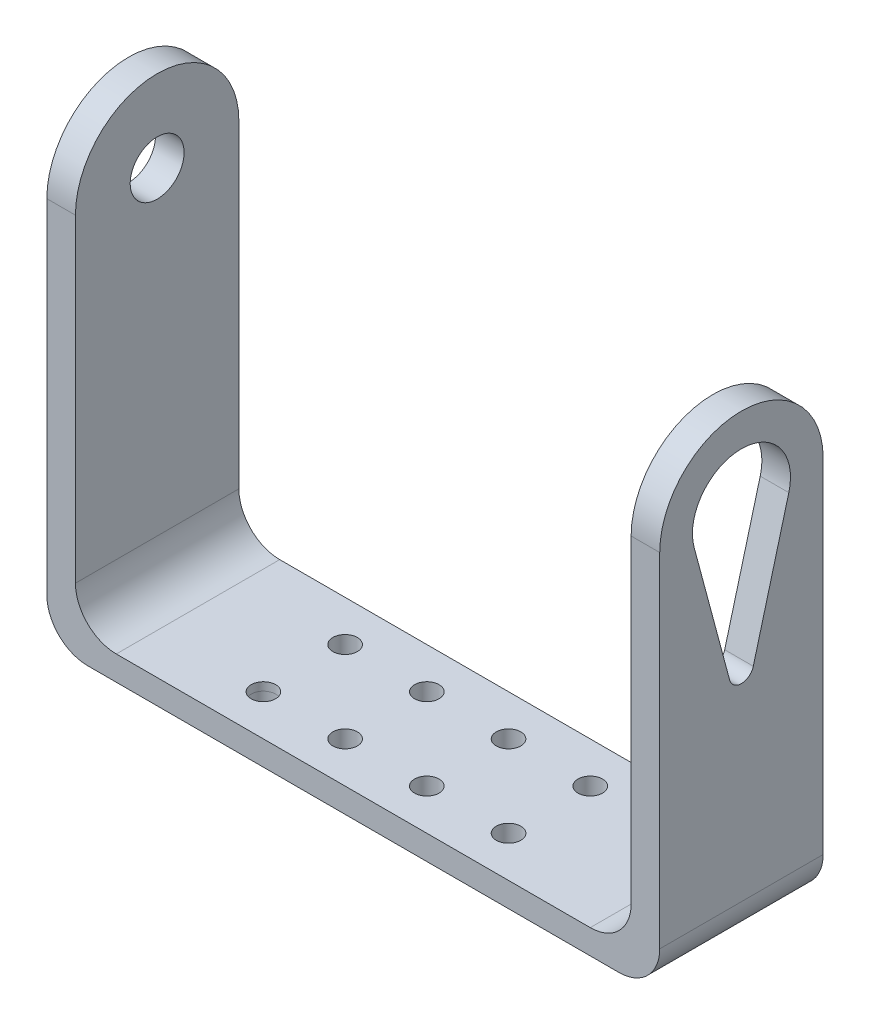
ISO-10303-21;
HEADER;
FILE_DESCRIPTION(('STEP AP214'),'2;1');
FILE_NAME('part.step','',(''),(''),'','','');
FILE_SCHEMA(('AUTOMOTIVE_DESIGN { 1 0 10303 214 1 1 1 1 }'));
ENDSEC;
DATA;
#1=APPLICATION_CONTEXT('core data for automotive mechanical design processes');
#2=APPLICATION_PROTOCOL_DEFINITION('international standard','automotive_design',2000,#1);
#3=PRODUCT_CONTEXT('',#1,'mechanical');
#4=PRODUCT('Part','Part','',(#3));
#5=PRODUCT_RELATED_PRODUCT_CATEGORY('part','',(#4));
#6=PRODUCT_DEFINITION_FORMATION('','',#4);
#7=PRODUCT_DEFINITION_CONTEXT('part definition',#1,'design');
#8=PRODUCT_DEFINITION('design','',#6,#7);
#9=PRODUCT_DEFINITION_SHAPE('','',#8);
#10=(LENGTH_UNIT() NAMED_UNIT(*) SI_UNIT(.MILLI.,.METRE.));
#11=(NAMED_UNIT(*) PLANE_ANGLE_UNIT() SI_UNIT($,.RADIAN.));
#12=(NAMED_UNIT(*) SI_UNIT($,.STERADIAN.) SOLID_ANGLE_UNIT());
#13=UNCERTAINTY_MEASURE_WITH_UNIT(LENGTH_MEASURE(1.E-05),#10,'distance_accuracy_value','');
#14=(GEOMETRIC_REPRESENTATION_CONTEXT(3) GLOBAL_UNCERTAINTY_ASSIGNED_CONTEXT((#13)) GLOBAL_UNIT_ASSIGNED_CONTEXT((#10,
#11,#12)) REPRESENTATION_CONTEXT('',''));
#15=CARTESIAN_POINT('',(0.,0.,0.));
#16=DIRECTION('',(0.,0.,1.));
#17=DIRECTION('',(1.,0.,0.));
#18=AXIS2_PLACEMENT_3D('',#15,#16,#17);
#19=CARTESIAN_POINT('',(35.,57.,-10.));
#20=DIRECTION('',(1.,0.,0.));
#21=DIRECTION('',(0.,0.,-1.));
#22=AXIS2_PLACEMENT_3D('',#19,#20,#21);
#23=PLANE('',#22);
#24=DIRECTION('',(0.,-1.,0.));
#25=VECTOR('',#24,1.);
#26=CARTESIAN_POINT('',(35.,57.,-10.));
#27=LINE('',#26,#25);
#28=CARTESIAN_POINT('',(35.,47.,-10.));
#29=VERTEX_POINT('',#28);
#30=CARTESIAN_POINT('',(35.,8.,-10.));
#31=VERTEX_POINT('',#30);
#32=EDGE_CURVE('E293',#29,#31,#27,.T.);
#33=ORIENTED_EDGE('',*,*,#32,.T.);
#34=DIRECTION('',(0.,0.,1.));
#35=VECTOR('',#34,1.);
#36=CARTESIAN_POINT('',(35.,8.,-10.));
#37=LINE('',#36,#35);
#38=CARTESIAN_POINT('',(35.,8.,10.));
#39=VERTEX_POINT('',#38);
#40=EDGE_CURVE('E353',#31,#39,#37,.T.);
#41=ORIENTED_EDGE('',*,*,#40,.T.);
#42=DIRECTION('',(0.,-1.,0.));
#43=VECTOR('',#42,1.);
#44=CARTESIAN_POINT('',(35.,57.,10.));
#45=LINE('',#44,#43);
#46=CARTESIAN_POINT('',(35.,47.,9.99999999999999));
#47=VERTEX_POINT('',#46);
#48=EDGE_CURVE('E290',#47,#39,#45,.T.);
#49=ORIENTED_EDGE('',*,*,#48,.F.);
#50=CARTESIAN_POINT('',(35.,47.,0.));
#51=DIRECTION('',(1.,0.,0.));
#52=DIRECTION('',(0.,0.,-1.));
#53=AXIS2_PLACEMENT_3D('',#50,#51,#52);
#54=CIRCLE('',#53,10.);
#55=EDGE_CURVE('E286',#29,#47,#54,.T.);
#56=ORIENTED_EDGE('',*,*,#55,.F.);
#57=EDGE_LOOP('',(#33,#41,#49,#56));
#58=FACE_BOUND('',#57,.T.);
#59=DIRECTION('',(0.,0.965925826289068,0.258819045102521));
#60=VECTOR('',#59,1.);
#61=CARTESIAN_POINT('',(35.,1.59548874045057,-5.9544450422656));
#62=LINE('',#61,#60);
#63=CARTESIAN_POINT('',(35.,29.225106559143,1.4488887394336));
#64=VERTEX_POINT('',#63);
#65=CARTESIAN_POINT('',(35.,45.4470857293849,5.7955549577344));
#66=VERTEX_POINT('',#65);
#67=EDGE_CURVE('E193',#64,#66,#62,.T.);
#68=ORIENTED_EDGE('',*,*,#67,.F.);
#69=CARTESIAN_POINT('',(35.,29.6133351267968,0.));
#70=DIRECTION('',(1.,0.,0.));
#71=DIRECTION('',(0.,0.,-1.));
#72=AXIS2_PLACEMENT_3D('',#69,#70,#71);
#73=CIRCLE('',#72,1.5);
#74=CARTESIAN_POINT('',(35.,29.225106559143,-1.4488887394336));
#75=VERTEX_POINT('',#74);
#76=EDGE_CURVE('E204',#64,#75,#73,.T.);
#77=ORIENTED_EDGE('',*,*,#76,.T.);
#78=DIRECTION('',(0.,0.965925826289068,-0.258819045102522));
#79=VECTOR('',#78,1.);
#80=CARTESIAN_POINT('',(35.,1.59548874045058,5.95444504226562));
#81=LINE('',#80,#79);
#82=CARTESIAN_POINT('',(35.,45.4470857293849,-5.79555495773442));
#83=VERTEX_POINT('',#82);
#84=EDGE_CURVE('E201',#75,#83,#81,.T.);
#85=ORIENTED_EDGE('',*,*,#84,.T.);
#86=CARTESIAN_POINT('',(35.,47.,0.));
#87=DIRECTION('',(1.,0.,0.));
#88=DIRECTION('',(0.,0.,-1.));
#89=AXIS2_PLACEMENT_3D('',#86,#87,#88);
#90=CIRCLE('',#89,6.);
#91=EDGE_CURVE('E212',#83,#66,#90,.T.);
#92=ORIENTED_EDGE('',*,*,#91,.T.);
#93=EDGE_LOOP('',(#68,#77,#85,#92));
#94=FACE_BOUND('',#93,.T.);
#95=ADVANCED_FACE('F77',(#58,#94),#23,.F.);
#96=CARTESIAN_POINT('',(38.5,2.,-10.));
#97=DIRECTION('',(-1.,0.,0.));
#98=DIRECTION('',(0.,0.,1.));
#99=AXIS2_PLACEMENT_3D('',#96,#97,#98);
#100=PLANE('',#99);
#101=DIRECTION('',(0.,-1.,0.));
#102=VECTOR('',#101,1.);
#103=CARTESIAN_POINT('',(38.5,2.,9.99999999999999));
#104=LINE('',#103,#102);
#105=CARTESIAN_POINT('',(38.5,47.,9.99999999999999));
#106=VERTEX_POINT('',#105);
#107=CARTESIAN_POINT('',(38.5,5.,9.99999999999999));
#108=VERTEX_POINT('',#107);
#109=EDGE_CURVE('E331',#106,#108,#104,.T.);
#110=ORIENTED_EDGE('',*,*,#109,.T.);
#111=DIRECTION('',(0.,0.,-1.));
#112=VECTOR('',#111,1.);
#113=CARTESIAN_POINT('',(38.5,5.,-10.));
#114=LINE('',#113,#112);
#115=CARTESIAN_POINT('',(38.5,5.,-10.));
#116=VERTEX_POINT('',#115);
#117=EDGE_CURVE('E363',#108,#116,#114,.T.);
#118=ORIENTED_EDGE('',*,*,#117,.T.);
#119=DIRECTION('',(0.,-1.,0.));
#120=VECTOR('',#119,1.);
#121=CARTESIAN_POINT('',(38.5,2.,-10.));
#122=LINE('',#121,#120);
#123=CARTESIAN_POINT('',(38.5,47.,-10.));
#124=VERTEX_POINT('',#123);
#125=EDGE_CURVE('E328',#124,#116,#122,.T.);
#126=ORIENTED_EDGE('',*,*,#125,.F.);
#127=CARTESIAN_POINT('',(38.5,47.,0.));
#128=DIRECTION('',(1.,0.,0.));
#129=DIRECTION('',(0.,0.,-1.));
#130=AXIS2_PLACEMENT_3D('',#127,#128,#129);
#131=CIRCLE('',#130,10.);
#132=EDGE_CURVE('E280',#124,#106,#131,.T.);
#133=ORIENTED_EDGE('',*,*,#132,.T.);
#134=EDGE_LOOP('',(#110,#118,#126,#133));
#135=FACE_BOUND('',#134,.T.);
#136=DIRECTION('',(0.,0.965925826289068,0.258819045102521));
#137=VECTOR('',#136,1.);
#138=CARTESIAN_POINT('',(38.5,1.59548874045057,-5.9544450422656));
#139=LINE('',#138,#137);
#140=CARTESIAN_POINT('',(38.5,29.225106559143,1.4488887394336));
#141=VERTEX_POINT('',#140);
#142=CARTESIAN_POINT('',(38.5,45.4470857293849,5.7955549577344));
#143=VERTEX_POINT('',#142);
#144=EDGE_CURVE('E196',#141,#143,#139,.T.);
#145=ORIENTED_EDGE('',*,*,#144,.T.);
#146=CARTESIAN_POINT('',(38.5,47.,0.));
#147=DIRECTION('',(1.,0.,0.));
#148=DIRECTION('',(0.,0.,-1.));
#149=AXIS2_PLACEMENT_3D('',#146,#147,#148);
#150=CIRCLE('',#149,6.);
#151=CARTESIAN_POINT('',(38.5,45.4470857293849,-5.79555495773441));
#152=VERTEX_POINT('',#151);
#153=EDGE_CURVE('E273',#152,#143,#150,.T.);
#154=ORIENTED_EDGE('',*,*,#153,.F.);
#155=DIRECTION('',(0.,0.965925826289068,-0.258819045102522));
#156=VECTOR('',#155,1.);
#157=CARTESIAN_POINT('',(38.5,1.59548874045058,5.95444504226562));
#158=LINE('',#157,#156);
#159=CARTESIAN_POINT('',(38.5,29.225106559143,-1.4488887394336));
#160=VERTEX_POINT('',#159);
#161=EDGE_CURVE('E92',#160,#152,#158,.T.);
#162=ORIENTED_EDGE('',*,*,#161,.F.);
#163=CARTESIAN_POINT('',(38.5,29.6133351267968,0.));
#164=DIRECTION('',(1.,0.,0.));
#165=DIRECTION('',(0.,0.,-1.));
#166=AXIS2_PLACEMENT_3D('',#163,#164,#165);
#167=CIRCLE('',#166,1.5);
#168=EDGE_CURVE('E214',#141,#160,#167,.T.);
#169=ORIENTED_EDGE('',*,*,#168,.F.);
#170=EDGE_LOOP('',(#145,#154,#162,#169));
#171=FACE_BOUND('',#170,.T.);
#172=ADVANCED_FACE('F386',(#135,#171),#100,.F.);
#173=CARTESIAN_POINT('',(30.,8.,-10.));
#174=DIRECTION('',(0.,0.,-1.));
#175=DIRECTION('',(-1.,0.,0.));
#176=AXIS2_PLACEMENT_3D('',#173,#174,#175);
#177=CYLINDRICAL_SURFACE('',#176,5.);
#178=ORIENTED_EDGE('',*,*,#40,.F.);
#179=CARTESIAN_POINT('',(30.,8.,-10.));
#180=DIRECTION('',(0.,0.,1.));
#181=DIRECTION('',(1.,0.,0.));
#182=AXIS2_PLACEMENT_3D('',#179,#180,#181);
#183=CIRCLE('',#182,5.);
#184=CARTESIAN_POINT('',(30.,3.,-10.));
#185=VERTEX_POINT('',#184);
#186=EDGE_CURVE('E359',#31,#185,#183,.F.);
#187=ORIENTED_EDGE('',*,*,#186,.T.);
#188=DIRECTION('',(0.,0.,1.));
#189=VECTOR('',#188,1.);
#190=CARTESIAN_POINT('',(30.,3.,-10.));
#191=LINE('',#190,#189);
#192=CARTESIAN_POINT('',(30.,3.,9.99999999999999));
#193=VERTEX_POINT('',#192);
#194=EDGE_CURVE('E356',#193,#185,#191,.F.);
#195=ORIENTED_EDGE('',*,*,#194,.F.);
#196=CARTESIAN_POINT('',(30.,8.,10.));
#197=DIRECTION('',(0.,0.,-1.));
#198=DIRECTION('',(-1.,0.,0.));
#199=AXIS2_PLACEMENT_3D('',#196,#197,#198);
#200=CIRCLE('',#199,5.);
#201=EDGE_CURVE('E361',#193,#39,#200,.F.);
#202=ORIENTED_EDGE('',*,*,#201,.T.);
#203=EDGE_LOOP('',(#178,#187,#195,#202));
#204=FACE_BOUND('',#203,.T.);
#205=ADVANCED_FACE('F424',(#204),#177,.F.);
#206=CARTESIAN_POINT('',(-28.,8.,0.));
#207=DIRECTION('',(0.,0.,-1.));
#208=DIRECTION('',(-1.,0.,0.));
#209=AXIS2_PLACEMENT_3D('',#206,#207,#208);
#210=CYLINDRICAL_SURFACE('',#209,5.);
#211=DIRECTION('',(0.,0.,1.));
#212=VECTOR('',#211,1.);
#213=CARTESIAN_POINT('',(-28.,3.,0.));
#214=LINE('',#213,#212);
#215=CARTESIAN_POINT('',(-28.,3.,-10.));
#216=VERTEX_POINT('',#215);
#217=CARTESIAN_POINT('',(-28.,3.,9.99999999999999));
#218=VERTEX_POINT('',#217);
#219=EDGE_CURVE('E334',#216,#218,#214,.T.);
#220=ORIENTED_EDGE('',*,*,#219,.F.);
#221=CARTESIAN_POINT('',(-28.,8.,-10.));
#222=DIRECTION('',(0.,0.,1.));
#223=DIRECTION('',(1.,0.,0.));
#224=AXIS2_PLACEMENT_3D('',#221,#222,#223);
#225=CIRCLE('',#224,5.);
#226=CARTESIAN_POINT('',(-33.,8.,-10.));
#227=VERTEX_POINT('',#226);
#228=EDGE_CURVE('E349',#216,#227,#225,.F.);
#229=ORIENTED_EDGE('',*,*,#228,.T.);
#230=DIRECTION('',(0.,0.,1.));
#231=VECTOR('',#230,1.);
#232=CARTESIAN_POINT('',(-33.,8.,0.));
#233=LINE('',#232,#231);
#234=CARTESIAN_POINT('',(-33.,8.,10.));
#235=VERTEX_POINT('',#234);
#236=EDGE_CURVE('E346',#235,#227,#233,.F.);
#237=ORIENTED_EDGE('',*,*,#236,.F.);
#238=CARTESIAN_POINT('',(-28.,8.,10.0000000000001));
#239=DIRECTION('',(0.,0.,-1.));
#240=DIRECTION('',(-1.,0.,0.));
#241=AXIS2_PLACEMENT_3D('',#238,#239,#240);
#242=CIRCLE('',#241,5.);
#243=EDGE_CURVE('E351',#235,#218,#242,.F.);
#244=ORIENTED_EDGE('',*,*,#243,.T.);
#245=EDGE_LOOP('',(#220,#229,#237,#244));
#246=FACE_BOUND('',#245,.T.);
#247=ADVANCED_FACE('F414',(#246),#210,.F.);
#248=CARTESIAN_POINT('',(-33.,57.,-10.));
#249=DIRECTION('',(-1.,0.,0.));
#250=DIRECTION('',(0.,0.,1.));
#251=AXIS2_PLACEMENT_3D('',#248,#249,#250);
#252=PLANE('',#251);
#253=CARTESIAN_POINT('',(-33.,47.,0.));
#254=DIRECTION('',(-1.,0.,0.));
#255=DIRECTION('',(0.,0.,1.));
#256=AXIS2_PLACEMENT_3D('',#253,#254,#255);
#257=CIRCLE('',#256,3.3);
#258=CARTESIAN_POINT('',(-33.,47.,3.30000000000005));
#259=VERTEX_POINT('',#258);
#260=EDGE_CURVE('E270',#259,#259,#257,.T.);
#261=ORIENTED_EDGE('',*,*,#260,.T.);
#262=EDGE_LOOP('',(#261));
#263=FACE_BOUND('',#262,.T.);
#264=DIRECTION('',(0.,-1.,0.));
#265=VECTOR('',#264,1.);
#266=CARTESIAN_POINT('',(-33.,57.,10.));
#267=LINE('',#266,#265);
#268=CARTESIAN_POINT('',(-33.,47.,9.99999999999999));
#269=VERTEX_POINT('',#268);
#270=EDGE_CURVE('E301',#269,#235,#267,.T.);
#271=ORIENTED_EDGE('',*,*,#270,.T.);
#272=ORIENTED_EDGE('',*,*,#236,.T.);
#273=DIRECTION('',(0.,-1.,0.));
#274=VECTOR('',#273,1.);
#275=CARTESIAN_POINT('',(-33.,57.,-10.));
#276=LINE('',#275,#274);
#277=CARTESIAN_POINT('',(-33.,47.,-10.));
#278=VERTEX_POINT('',#277);
#279=EDGE_CURVE('E296',#278,#227,#276,.T.);
#280=ORIENTED_EDGE('',*,*,#279,.F.);
#281=CARTESIAN_POINT('',(-33.,47.,0.));
#282=DIRECTION('',(-1.,0.,0.));
#283=DIRECTION('',(0.,0.,1.));
#284=AXIS2_PLACEMENT_3D('',#281,#282,#283);
#285=CIRCLE('',#284,10.);
#286=EDGE_CURVE('E288',#269,#278,#285,.T.);
#287=ORIENTED_EDGE('',*,*,#286,.F.);
#288=EDGE_LOOP('',(#271,#272,#280,#287));
#289=FACE_BOUND('',#288,.T.);
#290=ADVANCED_FACE('F410',(#263,#289),#252,.F.);
#291=CARTESIAN_POINT('',(35.,2.,10.));
#292=DIRECTION('',(0.,0.,-1.));
#293=DIRECTION('',(-1.,0.,0.));
#294=AXIS2_PLACEMENT_3D('',#291,#292,#293);
#295=PLANE('',#294);
#296=DIRECTION('',(1.,0.,0.));
#297=VECTOR('',#296,1.);
#298=CARTESIAN_POINT('',(35.,0.,10.));
#299=LINE('',#298,#297);
#300=CARTESIAN_POINT('',(-31.5,0.,10.0000000000001));
#301=VERTEX_POINT('',#300);
#302=CARTESIAN_POINT('',(33.5,0.,10.));
#303=VERTEX_POINT('',#302);
#304=EDGE_CURVE('E322',#301,#303,#299,.T.);
#305=ORIENTED_EDGE('',*,*,#304,.T.);
#306=CARTESIAN_POINT('',(33.5,5.,10.));
#307=DIRECTION('',(0.,0.,-1.));
#308=DIRECTION('',(-1.,0.,0.));
#309=AXIS2_PLACEMENT_3D('',#306,#307,#308);
#310=CIRCLE('',#309,5.);
#311=EDGE_CURVE('E85',#303,#108,#310,.F.);
#312=ORIENTED_EDGE('',*,*,#311,.T.);
#313=ORIENTED_EDGE('',*,*,#109,.F.);
#314=DIRECTION('',(1.,0.,0.));
#315=VECTOR('',#314,1.);
#316=CARTESIAN_POINT('',(-48.5,47.,9.99999999999999));
#317=LINE('',#316,#315);
#318=EDGE_CURVE('E276',#47,#106,#317,.T.);
#319=ORIENTED_EDGE('',*,*,#318,.F.);
#320=ORIENTED_EDGE('',*,*,#48,.T.);
#321=ORIENTED_EDGE('',*,*,#201,.F.);
#322=DIRECTION('',(1.,0.,0.));
#323=VECTOR('',#322,1.);
#324=CARTESIAN_POINT('',(-33.,3.,9.99999999999999));
#325=LINE('',#324,#323);
#326=EDGE_CURVE('E252',#218,#193,#325,.T.);
#327=ORIENTED_EDGE('',*,*,#326,.F.);
#328=ORIENTED_EDGE('',*,*,#243,.F.);
#329=ORIENTED_EDGE('',*,*,#270,.F.);
#330=CARTESIAN_POINT('',(-36.5,47.,9.99999999999999));
#331=VERTEX_POINT('',#330);
#332=EDGE_CURVE('E279',#331,#269,#317,.T.);
#333=ORIENTED_EDGE('',*,*,#332,.F.);
#334=DIRECTION('',(0.,-1.,0.));
#335=VECTOR('',#334,1.);
#336=CARTESIAN_POINT('',(-36.5,0.,10.));
#337=LINE('',#336,#335);
#338=CARTESIAN_POINT('',(-36.5,5.,10.));
#339=VERTEX_POINT('',#338);
#340=EDGE_CURVE('E268',#331,#339,#337,.T.);
#341=ORIENTED_EDGE('',*,*,#340,.T.);
#342=CARTESIAN_POINT('',(-31.5,5.,10.0000000000001));
#343=DIRECTION('',(0.,0.,-1.));
#344=DIRECTION('',(-1.,0.,0.));
#345=AXIS2_PLACEMENT_3D('',#342,#343,#344);
#346=CIRCLE('',#345,5.);
#347=EDGE_CURVE('E375',#339,#301,#346,.F.);
#348=ORIENTED_EDGE('',*,*,#347,.T.);
#349=EDGE_LOOP('',(#305,#312,#313,#319,#320,#321,#327,#328,#329,#333,#341,#348));
#350=FACE_BOUND('',#349,.T.);
#351=ADVANCED_FACE('F379',(#350),#295,.F.);
#352=CARTESIAN_POINT('',(0.,0.,0.));
#353=DIRECTION('',(0.,1.,0.));
#354=DIRECTION('',(0.,0.,1.));
#355=AXIS2_PLACEMENT_3D('',#352,#353,#354);
#356=PLANE('',#355);
#357=DIRECTION('',(-1.,0.,0.));
#358=VECTOR('',#357,1.);
#359=CARTESIAN_POINT('',(35.,0.,-10.));
#360=LINE('',#359,#358);
#361=CARTESIAN_POINT('',(33.5,0.,-10.));
#362=VERTEX_POINT('',#361);
#363=CARTESIAN_POINT('',(-31.5,0.,-10.));
#364=VERTEX_POINT('',#363);
#365=EDGE_CURVE('E325',#362,#364,#360,.T.);
#366=ORIENTED_EDGE('',*,*,#365,.F.);
#367=DIRECTION('',(0.,0.,-1.));
#368=VECTOR('',#367,1.);
#369=CARTESIAN_POINT('',(33.5,0.,0.));
#370=LINE('',#369,#368);
#371=EDGE_CURVE('E373',#362,#303,#370,.F.);
#372=ORIENTED_EDGE('',*,*,#371,.T.);
#373=ORIENTED_EDGE('',*,*,#304,.F.);
#374=DIRECTION('',(0.,0.,-1.));
#375=VECTOR('',#374,1.);
#376=CARTESIAN_POINT('',(-31.5,0.,-10.));
#377=LINE('',#376,#375);
#378=EDGE_CURVE('E370',#301,#364,#377,.T.);
#379=ORIENTED_EDGE('',*,*,#378,.T.);
#380=EDGE_LOOP('',(#366,#372,#373,#379));
#381=FACE_BOUND('',#380,.T.);
#382=CARTESIAN_POINT('',(-15.,0.,-5.));
#383=DIRECTION('',(0.,1.,0.));
#384=DIRECTION('',(0.,0.,1.));
#385=AXIS2_PLACEMENT_3D('',#382,#383,#384);
#386=CIRCLE('',#385,1.5);
#387=CARTESIAN_POINT('',(-15.,0.,-3.5));
#388=VERTEX_POINT('',#387);
#389=EDGE_CURVE('E319',#388,#388,#386,.T.);
#390=ORIENTED_EDGE('',*,*,#389,.T.);
#391=EDGE_LOOP('',(#390));
#392=FACE_BOUND('',#391,.T.);
#393=CARTESIAN_POINT('',(-5.,0.,-5.));
#394=DIRECTION('',(0.,1.,0.));
#395=DIRECTION('',(0.,0.,1.));
#396=AXIS2_PLACEMENT_3D('',#393,#394,#395);
#397=CIRCLE('',#396,1.5);
#398=CARTESIAN_POINT('',(-5.,0.,-3.5));
#399=VERTEX_POINT('',#398);
#400=EDGE_CURVE('E316',#399,#399,#397,.T.);
#401=ORIENTED_EDGE('',*,*,#400,.T.);
#402=EDGE_LOOP('',(#401));
#403=FACE_BOUND('',#402,.T.);
#404=CARTESIAN_POINT('',(-15.,0.,5.));
#405=DIRECTION('',(0.,1.,0.));
#406=DIRECTION('',(0.,0.,1.));
#407=AXIS2_PLACEMENT_3D('',#404,#405,#406);
#408=CIRCLE('',#407,1.5);
#409=CARTESIAN_POINT('',(-15.,0.,6.5));
#410=VERTEX_POINT('',#409);
#411=EDGE_CURVE('E313',#410,#410,#408,.T.);
#412=ORIENTED_EDGE('',*,*,#411,.T.);
#413=EDGE_LOOP('',(#412));
#414=FACE_BOUND('',#413,.T.);
#415=CARTESIAN_POINT('',(-5.,0.,5.));
#416=DIRECTION('',(0.,1.,0.));
#417=DIRECTION('',(0.,0.,1.));
#418=AXIS2_PLACEMENT_3D('',#415,#416,#417);
#419=CIRCLE('',#418,1.5);
#420=CARTESIAN_POINT('',(-5.,0.,6.5));
#421=VERTEX_POINT('',#420);
#422=EDGE_CURVE('E310',#421,#421,#419,.T.);
#423=ORIENTED_EDGE('',*,*,#422,.T.);
#424=EDGE_LOOP('',(#423));
#425=FACE_BOUND('',#424,.T.);
#426=CARTESIAN_POINT('',(15.,0.,5.));
#427=DIRECTION('',(0.,1.,0.));
#428=DIRECTION('',(0.,0.,-1.));
#429=AXIS2_PLACEMENT_3D('',#426,#427,#428);
#430=CIRCLE('',#429,1.5);
#431=CARTESIAN_POINT('',(15.,0.,3.5));
#432=VERTEX_POINT('',#431);
#433=EDGE_CURVE('E307',#432,#432,#430,.T.);
#434=ORIENTED_EDGE('',*,*,#433,.T.);
#435=EDGE_LOOP('',(#434));
#436=FACE_BOUND('',#435,.T.);
#437=CARTESIAN_POINT('',(5.,0.,5.));
#438=DIRECTION('',(0.,1.,0.));
#439=DIRECTION('',(0.,0.,-1.));
#440=AXIS2_PLACEMENT_3D('',#437,#438,#439);
#441=CIRCLE('',#440,1.5);
#442=CARTESIAN_POINT('',(5.,0.,3.5));
#443=VERTEX_POINT('',#442);
#444=EDGE_CURVE('E304',#443,#443,#441,.T.);
#445=ORIENTED_EDGE('',*,*,#444,.T.);
#446=EDGE_LOOP('',(#445));
#447=FACE_BOUND('',#446,.T.);
#448=CARTESIAN_POINT('',(5.,0.,-5.));
#449=DIRECTION('',(0.,1.,0.));
#450=DIRECTION('',(0.,0.,-1.));
#451=AXIS2_PLACEMENT_3D('',#448,#449,#450);
#452=CIRCLE('',#451,1.5);
#453=CARTESIAN_POINT('',(5.,0.,-6.5));
#454=VERTEX_POINT('',#453);
#455=EDGE_CURVE('E300',#454,#454,#452,.T.);
#456=ORIENTED_EDGE('',*,*,#455,.T.);
#457=EDGE_LOOP('',(#456));
#458=FACE_BOUND('',#457,.T.);
#459=CARTESIAN_POINT('',(15.,0.,-5.));
#460=DIRECTION('',(0.,1.,0.));
#461=DIRECTION('',(0.,0.,-1.));
#462=AXIS2_PLACEMENT_3D('',#459,#460,#461);
#463=CIRCLE('',#462,1.5);
#464=CARTESIAN_POINT('',(15.,0.,-6.5));
#465=VERTEX_POINT('',#464);
#466=EDGE_CURVE('E297',#465,#465,#463,.T.);
#467=ORIENTED_EDGE('',*,*,#466,.T.);
#468=EDGE_LOOP('',(#467));
#469=FACE_BOUND('',#468,.T.);
#470=ADVANCED_FACE('F394',(#381,#392,#403,#414,#425,#436,#447,#458,#469),#356,.F.);
#471=CARTESIAN_POINT('',(35.,2.,-10.));
#472=DIRECTION('',(0.,0.,1.));
#473=DIRECTION('',(1.,0.,0.));
#474=AXIS2_PLACEMENT_3D('',#471,#472,#473);
#475=PLANE('',#474);
#476=ORIENTED_EDGE('',*,*,#125,.T.);
#477=CARTESIAN_POINT('',(33.5,5.,-10.));
#478=DIRECTION('',(0.,0.,1.));
#479=DIRECTION('',(1.,0.,0.));
#480=AXIS2_PLACEMENT_3D('',#477,#478,#479);
#481=CIRCLE('',#480,5.);
#482=EDGE_CURVE('E368',#116,#362,#481,.F.);
#483=ORIENTED_EDGE('',*,*,#482,.T.);
#484=ORIENTED_EDGE('',*,*,#365,.T.);
#485=CARTESIAN_POINT('',(-31.5,5.,-10.));
#486=DIRECTION('',(0.,0.,1.));
#487=DIRECTION('',(1.,0.,0.));
#488=AXIS2_PLACEMENT_3D('',#485,#486,#487);
#489=CIRCLE('',#488,5.);
#490=CARTESIAN_POINT('',(-36.5,5.,-10.));
#491=VERTEX_POINT('',#490);
#492=EDGE_CURVE('E366',#364,#491,#489,.F.);
#493=ORIENTED_EDGE('',*,*,#492,.T.);
#494=DIRECTION('',(0.,1.,0.));
#495=VECTOR('',#494,1.);
#496=CARTESIAN_POINT('',(-36.5,0.,-10.));
#497=LINE('',#496,#495);
#498=CARTESIAN_POINT('',(-36.5,47.,-10.));
#499=VERTEX_POINT('',#498);
#500=EDGE_CURVE('E266',#491,#499,#497,.T.);
#501=ORIENTED_EDGE('',*,*,#500,.T.);
#502=DIRECTION('',(1.,0.,0.));
#503=VECTOR('',#502,1.);
#504=CARTESIAN_POINT('',(-48.5,47.,-10.));
#505=LINE('',#504,#503);
#506=EDGE_CURVE('E285',#499,#278,#505,.T.);
#507=ORIENTED_EDGE('',*,*,#506,.T.);
#508=ORIENTED_EDGE('',*,*,#279,.T.);
#509=ORIENTED_EDGE('',*,*,#228,.F.);
#510=DIRECTION('',(-1.,0.,0.));
#511=VECTOR('',#510,1.);
#512=CARTESIAN_POINT('',(-33.,3.,-10.));
#513=LINE('',#512,#511);
#514=EDGE_CURVE('E255',#185,#216,#513,.T.);
#515=ORIENTED_EDGE('',*,*,#514,.F.);
#516=ORIENTED_EDGE('',*,*,#186,.F.);
#517=ORIENTED_EDGE('',*,*,#32,.F.);
#518=EDGE_CURVE('E282',#29,#124,#505,.T.);
#519=ORIENTED_EDGE('',*,*,#518,.T.);
#520=EDGE_LOOP('',(#476,#483,#484,#493,#501,#507,#508,#509,#515,#516,#517,#519));
#521=FACE_BOUND('',#520,.T.);
#522=ADVANCED_FACE('F392',(#521),#475,.F.);
#523=CARTESIAN_POINT('',(-15.,2.,-5.));
#524=DIRECTION('',(0.,-1.,0.));
#525=DIRECTION('',(0.,0.,-1.));
#526=AXIS2_PLACEMENT_3D('',#523,#524,#525);
#527=CYLINDRICAL_SURFACE('',#526,1.5);
#528=ORIENTED_EDGE('',*,*,#389,.F.);
#529=EDGE_LOOP('',(#528));
#530=FACE_BOUND('',#529,.T.);
#531=CARTESIAN_POINT('',(-15.,3.,-5.));
#532=DIRECTION('',(0.,1.,0.));
#533=DIRECTION('',(0.,0.,1.));
#534=AXIS2_PLACEMENT_3D('',#531,#532,#533);
#535=CIRCLE('',#534,1.5);
#536=CARTESIAN_POINT('',(-15.,3.,-3.5));
#537=VERTEX_POINT('',#536);
#538=EDGE_CURVE('E249',#537,#537,#535,.T.);
#539=ORIENTED_EDGE('',*,*,#538,.T.);
#540=EDGE_LOOP('',(#539));
#541=FACE_BOUND('',#540,.T.);
#542=ADVANCED_FACE('F474',(#530,#541),#527,.F.);
#543=CARTESIAN_POINT('',(-5.,2.,-5.));
#544=DIRECTION('',(0.,-1.,0.));
#545=DIRECTION('',(0.,0.,-1.));
#546=AXIS2_PLACEMENT_3D('',#543,#544,#545);
#547=CYLINDRICAL_SURFACE('',#546,1.5);
#548=ORIENTED_EDGE('',*,*,#400,.F.);
#549=EDGE_LOOP('',(#548));
#550=FACE_BOUND('',#549,.T.);
#551=CARTESIAN_POINT('',(-5.,3.,-5.));
#552=DIRECTION('',(0.,1.,0.));
#553=DIRECTION('',(0.,0.,1.));
#554=AXIS2_PLACEMENT_3D('',#551,#552,#553);
#555=CIRCLE('',#554,1.5);
#556=CARTESIAN_POINT('',(-5.,3.,-3.5));
#557=VERTEX_POINT('',#556);
#558=EDGE_CURVE('E246',#557,#557,#555,.T.);
#559=ORIENTED_EDGE('',*,*,#558,.T.);
#560=EDGE_LOOP('',(#559));
#561=FACE_BOUND('',#560,.T.);
#562=ADVANCED_FACE('F470',(#550,#561),#547,.F.);
#563=CARTESIAN_POINT('',(-15.,2.,5.));
#564=DIRECTION('',(0.,-1.,0.));
#565=DIRECTION('',(0.,0.,-1.));
#566=AXIS2_PLACEMENT_3D('',#563,#564,#565);
#567=CYLINDRICAL_SURFACE('',#566,1.5);
#568=CARTESIAN_POINT('',(-15.,2.,5.));
#569=DIRECTION('',(0.,-1.,0.));
#570=DIRECTION('',(0.,0.,-1.));
#571=AXIS2_PLACEMENT_3D('',#568,#569,#570);
#572=CIRCLE('',#571,1.5);
#573=CARTESIAN_POINT('',(-15.,2.,3.50000000000001));
#574=VERTEX_POINT('',#573);
#575=EDGE_CURVE('E257',#574,#574,#572,.T.);
#576=ORIENTED_EDGE('',*,*,#575,.F.);
#577=EDGE_LOOP('',(#576));
#578=FACE_BOUND('',#577,.T.);
#579=ORIENTED_EDGE('',*,*,#411,.F.);
#580=EDGE_LOOP('',(#579));
#581=FACE_BOUND('',#580,.T.);
#582=ADVANCED_FACE('F466',(#578,#581),#567,.F.);
#583=CARTESIAN_POINT('',(-5.,2.,5.));
#584=DIRECTION('',(0.,-1.,0.));
#585=DIRECTION('',(0.,0.,-1.));
#586=AXIS2_PLACEMENT_3D('',#583,#584,#585);
#587=CYLINDRICAL_SURFACE('',#586,1.5);
#588=ORIENTED_EDGE('',*,*,#422,.F.);
#589=EDGE_LOOP('',(#588));
#590=FACE_BOUND('',#589,.T.);
#591=CARTESIAN_POINT('',(-5.,3.,5.));
#592=DIRECTION('',(0.,1.,0.));
#593=DIRECTION('',(0.,0.,1.));
#594=AXIS2_PLACEMENT_3D('',#591,#592,#593);
#595=CIRCLE('',#594,1.5);
#596=CARTESIAN_POINT('',(-5.,3.,6.5));
#597=VERTEX_POINT('',#596);
#598=EDGE_CURVE('E229',#597,#597,#595,.T.);
#599=ORIENTED_EDGE('',*,*,#598,.T.);
#600=EDGE_LOOP('',(#599));
#601=FACE_BOUND('',#600,.T.);
#602=ADVANCED_FACE('F462',(#590,#601),#587,.F.);
#603=CARTESIAN_POINT('',(15.,2.,5.));
#604=DIRECTION('',(0.,-1.,0.));
#605=DIRECTION('',(0.,0.,-1.));
#606=AXIS2_PLACEMENT_3D('',#603,#604,#605);
#607=CYLINDRICAL_SURFACE('',#606,1.5);
#608=ORIENTED_EDGE('',*,*,#433,.F.);
#609=EDGE_LOOP('',(#608));
#610=FACE_BOUND('',#609,.T.);
#611=CARTESIAN_POINT('',(15.,3.,5.));
#612=DIRECTION('',(0.,1.,0.));
#613=DIRECTION('',(0.,0.,1.));
#614=AXIS2_PLACEMENT_3D('',#611,#612,#613);
#615=CIRCLE('',#614,1.5);
#616=CARTESIAN_POINT('',(15.,3.,6.5));
#617=VERTEX_POINT('',#616);
#618=EDGE_CURVE('E237',#617,#617,#615,.T.);
#619=ORIENTED_EDGE('',*,*,#618,.T.);
#620=EDGE_LOOP('',(#619));
#621=FACE_BOUND('',#620,.T.);
#622=ADVANCED_FACE('F458',(#610,#621),#607,.F.);
#623=CARTESIAN_POINT('',(5.,2.,5.));
#624=DIRECTION('',(0.,-1.,0.));
#625=DIRECTION('',(0.,0.,-1.));
#626=AXIS2_PLACEMENT_3D('',#623,#624,#625);
#627=CYLINDRICAL_SURFACE('',#626,1.5);
#628=ORIENTED_EDGE('',*,*,#444,.F.);
#629=EDGE_LOOP('',(#628));
#630=FACE_BOUND('',#629,.T.);
#631=CARTESIAN_POINT('',(5.,3.,5.));
#632=DIRECTION('',(0.,1.,0.));
#633=DIRECTION('',(0.,0.,1.));
#634=AXIS2_PLACEMENT_3D('',#631,#632,#633);
#635=CIRCLE('',#634,1.5);
#636=CARTESIAN_POINT('',(5.,3.,6.5));
#637=VERTEX_POINT('',#636);
#638=EDGE_CURVE('E234',#637,#637,#635,.T.);
#639=ORIENTED_EDGE('',*,*,#638,.T.);
#640=EDGE_LOOP('',(#639));
#641=FACE_BOUND('',#640,.T.);
#642=ADVANCED_FACE('F454',(#630,#641),#627,.F.);
#643=CARTESIAN_POINT('',(5.,2.,-5.));
#644=DIRECTION('',(0.,-1.,0.));
#645=DIRECTION('',(0.,0.,-1.));
#646=AXIS2_PLACEMENT_3D('',#643,#644,#645);
#647=CYLINDRICAL_SURFACE('',#646,1.5);
#648=ORIENTED_EDGE('',*,*,#455,.F.);
#649=EDGE_LOOP('',(#648));
#650=FACE_BOUND('',#649,.T.);
#651=CARTESIAN_POINT('',(5.,3.,-5.));
#652=DIRECTION('',(0.,1.,0.));
#653=DIRECTION('',(0.,0.,1.));
#654=AXIS2_PLACEMENT_3D('',#651,#652,#653);
#655=CIRCLE('',#654,1.5);
#656=CARTESIAN_POINT('',(5.,3.,-3.5));
#657=VERTEX_POINT('',#656);
#658=EDGE_CURVE('E243',#657,#657,#655,.T.);
#659=ORIENTED_EDGE('',*,*,#658,.T.);
#660=EDGE_LOOP('',(#659));
#661=FACE_BOUND('',#660,.T.);
#662=ADVANCED_FACE('F438',(#650,#661),#647,.F.);
#663=CARTESIAN_POINT('',(15.,2.,-5.));
#664=DIRECTION('',(0.,-1.,0.));
#665=DIRECTION('',(0.,0.,-1.));
#666=AXIS2_PLACEMENT_3D('',#663,#664,#665);
#667=CYLINDRICAL_SURFACE('',#666,1.5);
#668=ORIENTED_EDGE('',*,*,#466,.F.);
#669=EDGE_LOOP('',(#668));
#670=FACE_BOUND('',#669,.T.);
#671=CARTESIAN_POINT('',(15.,3.,-5.));
#672=DIRECTION('',(0.,1.,0.));
#673=DIRECTION('',(0.,0.,1.));
#674=AXIS2_PLACEMENT_3D('',#671,#672,#673);
#675=CIRCLE('',#674,1.5);
#676=CARTESIAN_POINT('',(15.,3.,-3.5));
#677=VERTEX_POINT('',#676);
#678=EDGE_CURVE('E240',#677,#677,#675,.T.);
#679=ORIENTED_EDGE('',*,*,#678,.T.);
#680=EDGE_LOOP('',(#679));
#681=FACE_BOUND('',#680,.T.);
#682=ADVANCED_FACE('F431',(#670,#681),#667,.F.);
#683=CARTESIAN_POINT('',(-48.5,47.,0.));
#684=DIRECTION('',(1.,0.,0.));
#685=DIRECTION('',(0.,0.,-1.));
#686=AXIS2_PLACEMENT_3D('',#683,#684,#685);
#687=CYLINDRICAL_SURFACE('',#686,10.);
#688=ORIENTED_EDGE('',*,*,#55,.T.);
#689=ORIENTED_EDGE('',*,*,#318,.T.);
#690=ORIENTED_EDGE('',*,*,#132,.F.);
#691=ORIENTED_EDGE('',*,*,#518,.F.);
#692=EDGE_LOOP('',(#688,#689,#690,#691));
#693=FACE_BOUND('',#692,.T.);
#694=ADVANCED_FACE('F429',(#693),#687,.T.);
#695=ORIENTED_EDGE('',*,*,#506,.F.);
#696=CARTESIAN_POINT('',(-36.5,47.,0.));
#697=DIRECTION('',(-1.,0.,0.));
#698=DIRECTION('',(0.,0.,1.));
#699=AXIS2_PLACEMENT_3D('',#696,#697,#698);
#700=CIRCLE('',#699,10.);
#701=EDGE_CURVE('E263',#499,#331,#700,.F.);
#702=ORIENTED_EDGE('',*,*,#701,.T.);
#703=ORIENTED_EDGE('',*,*,#332,.T.);
#704=ORIENTED_EDGE('',*,*,#286,.T.);
#705=EDGE_LOOP('',(#695,#702,#703,#704));
#706=FACE_BOUND('',#705,.T.);
#707=ADVANCED_FACE('F405',(#706),#687,.T.);
#708=CARTESIAN_POINT('',(-48.5,47.,0.));
#709=DIRECTION('',(1.,0.,0.));
#710=DIRECTION('',(0.,0.,-1.));
#711=AXIS2_PLACEMENT_3D('',#708,#709,#710);
#712=CYLINDRICAL_SURFACE('',#711,6.);
#713=ORIENTED_EDGE('',*,*,#153,.T.);
#714=DIRECTION('',(1.,0.,0.));
#715=VECTOR('',#714,1.);
#716=CARTESIAN_POINT('',(35.,45.4470857293849,5.7955549577344));
#717=LINE('',#716,#715);
#718=EDGE_CURVE('E220',#66,#143,#717,.T.);
#719=ORIENTED_EDGE('',*,*,#718,.F.);
#720=ORIENTED_EDGE('',*,*,#91,.F.);
#721=DIRECTION('',(1.,0.,0.));
#722=VECTOR('',#721,1.);
#723=CARTESIAN_POINT('',(35.,45.4470857293849,-5.79555495773442));
#724=LINE('',#723,#722);
#725=EDGE_CURVE('E223',#83,#152,#724,.T.);
#726=ORIENTED_EDGE('',*,*,#725,.T.);
#727=EDGE_LOOP('',(#713,#719,#720,#726));
#728=FACE_BOUND('',#727,.T.);
#729=ADVANCED_FACE('F437',(#728),#712,.F.);
#730=CARTESIAN_POINT('',(-33.,47.,0.));
#731=DIRECTION('',(-1.,0.,0.));
#732=DIRECTION('',(0.,0.,1.));
#733=AXIS2_PLACEMENT_3D('',#730,#731,#732);
#734=CYLINDRICAL_SURFACE('',#733,3.3);
#735=ORIENTED_EDGE('',*,*,#260,.F.);
#736=EDGE_LOOP('',(#735));
#737=FACE_BOUND('',#736,.T.);
#738=CARTESIAN_POINT('',(-36.5,47.,0.));
#739=DIRECTION('',(-1.,0.,0.));
#740=DIRECTION('',(0.,0.,1.));
#741=AXIS2_PLACEMENT_3D('',#738,#739,#740);
#742=CIRCLE('',#741,3.3);
#743=CARTESIAN_POINT('',(-36.5,47.,3.30000000000005));
#744=VERTEX_POINT('',#743);
#745=EDGE_CURVE('E260',#744,#744,#742,.T.);
#746=ORIENTED_EDGE('',*,*,#745,.T.);
#747=EDGE_LOOP('',(#746));
#748=FACE_BOUND('',#747,.T.);
#749=ADVANCED_FACE('F510',(#737,#748),#734,.F.);
#750=CARTESIAN_POINT('',(-36.5,0.,0.));
#751=DIRECTION('',(-1.,0.,0.));
#752=DIRECTION('',(0.,0.,1.));
#753=AXIS2_PLACEMENT_3D('',#750,#751,#752);
#754=PLANE('',#753);
#755=ORIENTED_EDGE('',*,*,#745,.F.);
#756=EDGE_LOOP('',(#755));
#757=FACE_BOUND('',#756,.T.);
#758=ORIENTED_EDGE('',*,*,#500,.F.);
#759=DIRECTION('',(0.,0.,-1.));
#760=VECTOR('',#759,1.);
#761=CARTESIAN_POINT('',(-36.5,5.,10.));
#762=LINE('',#761,#760);
#763=EDGE_CURVE('E12',#491,#339,#762,.F.);
#764=ORIENTED_EDGE('',*,*,#763,.T.);
#765=ORIENTED_EDGE('',*,*,#340,.F.);
#766=ORIENTED_EDGE('',*,*,#701,.F.);
#767=EDGE_LOOP('',(#758,#764,#765,#766));
#768=FACE_BOUND('',#767,.T.);
#769=ADVANCED_FACE('F402',(#757,#768),#754,.T.);
#770=CARTESIAN_POINT('',(0.,3.,0.));
#771=DIRECTION('',(0.,-1.,0.));
#772=DIRECTION('',(0.,0.,-1.));
#773=AXIS2_PLACEMENT_3D('',#770,#771,#772);
#774=PLANE('',#773);
#775=ORIENTED_EDGE('',*,*,#326,.T.);
#776=ORIENTED_EDGE('',*,*,#194,.T.);
#777=ORIENTED_EDGE('',*,*,#514,.T.);
#778=ORIENTED_EDGE('',*,*,#219,.T.);
#779=EDGE_LOOP('',(#775,#776,#777,#778));
#780=FACE_BOUND('',#779,.T.);
#781=ORIENTED_EDGE('',*,*,#538,.F.);
#782=EDGE_LOOP('',(#781));
#783=FACE_BOUND('',#782,.T.);
#784=ORIENTED_EDGE('',*,*,#558,.F.);
#785=EDGE_LOOP('',(#784));
#786=FACE_BOUND('',#785,.T.);
#787=ORIENTED_EDGE('',*,*,#658,.F.);
#788=EDGE_LOOP('',(#787));
#789=FACE_BOUND('',#788,.T.);
#790=ORIENTED_EDGE('',*,*,#678,.F.);
#791=EDGE_LOOP('',(#790));
#792=FACE_BOUND('',#791,.T.);
#793=ORIENTED_EDGE('',*,*,#618,.F.);
#794=EDGE_LOOP('',(#793));
#795=FACE_BOUND('',#794,.T.);
#796=ORIENTED_EDGE('',*,*,#638,.F.);
#797=EDGE_LOOP('',(#796));
#798=FACE_BOUND('',#797,.T.);
#799=ORIENTED_EDGE('',*,*,#598,.F.);
#800=EDGE_LOOP('',(#799));
#801=FACE_BOUND('',#800,.T.);
#802=CARTESIAN_POINT('',(-15.,3.,5.));
#803=DIRECTION('',(0.,1.,0.));
#804=DIRECTION('',(0.,0.,1.));
#805=AXIS2_PLACEMENT_3D('',#802,#803,#804);
#806=CIRCLE('',#805,1.49887169518485);
#807=CARTESIAN_POINT('',(-15.,3.,6.49887169518485));
#808=VERTEX_POINT('',#807);
#809=EDGE_CURVE('E226',#808,#808,#806,.T.);
#810=ORIENTED_EDGE('',*,*,#809,.F.);
#811=EDGE_LOOP('',(#810));
#812=FACE_BOUND('',#811,.T.);
#813=ADVANCED_FACE('F419',(#780,#783,#786,#789,#792,#795,#798,#801,#812),#774,.F.);
#814=CARTESIAN_POINT('',(0.,2.,0.));
#815=DIRECTION('',(0.,-1.,0.));
#816=DIRECTION('',(0.,0.,-1.));
#817=AXIS2_PLACEMENT_3D('',#814,#815,#816);
#818=PLANE('',#817);
#819=ORIENTED_EDGE('',*,*,#575,.T.);
#820=EDGE_LOOP('',(#819));
#821=FACE_BOUND('',#820,.T.);
#822=CARTESIAN_POINT('',(-15.,2.,5.));
#823=DIRECTION('',(0.,1.,0.));
#824=DIRECTION('',(0.,0.,1.));
#825=AXIS2_PLACEMENT_3D('',#822,#823,#824);
#826=CIRCLE('',#825,1.49887169518485);
#827=CARTESIAN_POINT('',(-15.,2.,6.49887169518485));
#828=VERTEX_POINT('',#827);
#829=EDGE_CURVE('E222',#828,#828,#826,.T.);
#830=ORIENTED_EDGE('',*,*,#829,.T.);
#831=EDGE_LOOP('',(#830));
#832=FACE_BOUND('',#831,.T.);
#833=ADVANCED_FACE('F494',(#821,#832),#818,.T.);
#834=CARTESIAN_POINT('',(-15.,3.,5.));
#835=DIRECTION('',(0.,-1.,0.));
#836=DIRECTION('',(0.,0.,-1.));
#837=AXIS2_PLACEMENT_3D('',#834,#835,#836);
#838=CYLINDRICAL_SURFACE('',#837,1.49887169518485);
#839=ORIENTED_EDGE('',*,*,#809,.T.);
#840=EDGE_LOOP('',(#839));
#841=FACE_BOUND('',#840,.T.);
#842=ORIENTED_EDGE('',*,*,#829,.F.);
#843=EDGE_LOOP('',(#842));
#844=FACE_BOUND('',#843,.T.);
#845=ADVANCED_FACE('F489',(#841,#844),#838,.F.);
#846=CARTESIAN_POINT('',(33.5,5.,-10.));
#847=DIRECTION('',(0.,0.,-1.));
#848=DIRECTION('',(-1.,0.,0.));
#849=AXIS2_PLACEMENT_3D('',#846,#847,#848);
#850=CYLINDRICAL_SURFACE('',#849,5.);
#851=ORIENTED_EDGE('',*,*,#311,.F.);
#852=ORIENTED_EDGE('',*,*,#371,.F.);
#853=ORIENTED_EDGE('',*,*,#482,.F.);
#854=ORIENTED_EDGE('',*,*,#117,.F.);
#855=EDGE_LOOP('',(#851,#852,#853,#854));
#856=FACE_BOUND('',#855,.T.);
#857=ADVANCED_FACE('F389',(#856),#850,.T.);
#858=CARTESIAN_POINT('',(-31.5,5.,0.));
#859=DIRECTION('',(0.,0.,1.));
#860=DIRECTION('',(1.,0.,0.));
#861=AXIS2_PLACEMENT_3D('',#858,#859,#860);
#862=CYLINDRICAL_SURFACE('',#861,5.);
#863=ORIENTED_EDGE('',*,*,#347,.F.);
#864=ORIENTED_EDGE('',*,*,#763,.F.);
#865=ORIENTED_EDGE('',*,*,#492,.F.);
#866=ORIENTED_EDGE('',*,*,#378,.F.);
#867=EDGE_LOOP('',(#863,#864,#865,#866));
#868=FACE_BOUND('',#867,.T.);
#869=ADVANCED_FACE('F79',(#868),#862,.T.);
#870=CARTESIAN_POINT('',(35.,1.59548874045057,-5.9544450422656));
#871=DIRECTION('',(0.,0.258819045102521,-0.965925826289068));
#872=DIRECTION('',(0.,0.965925826289068,0.258819045102521));
#873=AXIS2_PLACEMENT_3D('',#870,#871,#872);
#874=PLANE('',#873);
#875=ORIENTED_EDGE('',*,*,#144,.F.);
#876=DIRECTION('',(1.,0.,0.));
#877=VECTOR('',#876,1.);
#878=CARTESIAN_POINT('',(35.,29.225106559143,1.4488887394336));
#879=LINE('',#878,#877);
#880=EDGE_CURVE('E189',#64,#141,#879,.T.);
#881=ORIENTED_EDGE('',*,*,#880,.F.);
#882=ORIENTED_EDGE('',*,*,#67,.T.);
#883=ORIENTED_EDGE('',*,*,#718,.T.);
#884=EDGE_LOOP('',(#875,#881,#882,#883));
#885=FACE_BOUND('',#884,.T.);
#886=ADVANCED_FACE('F191',(#885),#874,.T.);
#887=CARTESIAN_POINT('',(35.,1.59548874045058,5.95444504226562));
#888=DIRECTION('',(0.,-0.258819045102522,-0.965925826289068));
#889=DIRECTION('',(0.,0.965925826289068,-0.258819045102522));
#890=AXIS2_PLACEMENT_3D('',#887,#888,#889);
#891=PLANE('',#890);
#892=ORIENTED_EDGE('',*,*,#161,.T.);
#893=ORIENTED_EDGE('',*,*,#725,.F.);
#894=ORIENTED_EDGE('',*,*,#84,.F.);
#895=DIRECTION('',(1.,0.,0.));
#896=VECTOR('',#895,1.);
#897=CARTESIAN_POINT('',(35.,29.225106559143,-1.4488887394336));
#898=LINE('',#897,#896);
#899=EDGE_CURVE('E200',#75,#160,#898,.T.);
#900=ORIENTED_EDGE('',*,*,#899,.T.);
#901=EDGE_LOOP('',(#892,#893,#894,#900));
#902=FACE_BOUND('',#901,.T.);
#903=ADVANCED_FACE('F519',(#902),#891,.F.);
#904=CARTESIAN_POINT('',(35.,29.6133351267968,0.));
#905=DIRECTION('',(1.,0.,0.));
#906=DIRECTION('',(0.,0.,-1.));
#907=AXIS2_PLACEMENT_3D('',#904,#905,#906);
#908=CYLINDRICAL_SURFACE('',#907,1.5);
#909=ORIENTED_EDGE('',*,*,#168,.T.);
#910=ORIENTED_EDGE('',*,*,#899,.F.);
#911=ORIENTED_EDGE('',*,*,#76,.F.);
#912=ORIENTED_EDGE('',*,*,#880,.T.);
#913=EDGE_LOOP('',(#909,#910,#911,#912));
#914=FACE_BOUND('',#913,.T.);
#915=ADVANCED_FACE('F205',(#914),#908,.F.);
#916=CLOSED_SHELL('',(#95,#172,#205,#247,#290,#351,#470,#522,#542,#562,#582,#602,#622,#642,#662,
#682,#694,#707,#729,#749,#769,#813,#833,#845,#857,#869,#886,#903,#915));
#917=MANIFOLD_SOLID_BREP('B2',#916);
#918=ADVANCED_BREP_SHAPE_REPRESENTATION('',(#18,#917),#14);
#919=SHAPE_DEFINITION_REPRESENTATION(#9,#918);
ENDSEC;
END-ISO-10303-21;
